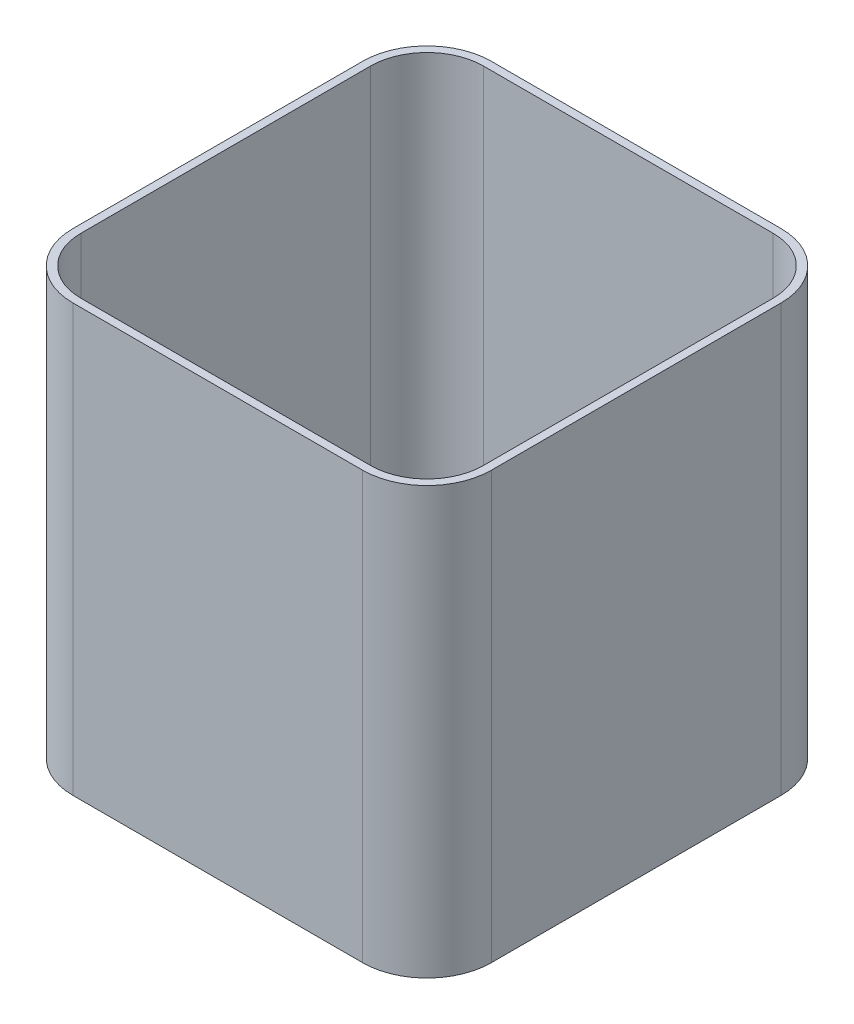
ISO-10303-21;
HEADER;
FILE_DESCRIPTION(('STEP AP214'),'2;1');
FILE_NAME('part.step','',(''),(''),'','','');
FILE_SCHEMA(('AUTOMOTIVE_DESIGN { 1 0 10303 214 1 1 1 1 }'));
ENDSEC;
DATA;
#1=APPLICATION_CONTEXT('core data for automotive mechanical design processes');
#2=APPLICATION_PROTOCOL_DEFINITION('international standard','automotive_design',2000,#1);
#3=PRODUCT_CONTEXT('',#1,'mechanical');
#4=PRODUCT('Part','Part','',(#3));
#5=PRODUCT_RELATED_PRODUCT_CATEGORY('part','',(#4));
#6=PRODUCT_DEFINITION_FORMATION('','',#4);
#7=PRODUCT_DEFINITION_CONTEXT('part definition',#1,'design');
#8=PRODUCT_DEFINITION('design','',#6,#7);
#9=PRODUCT_DEFINITION_SHAPE('','',#8);
#10=(LENGTH_UNIT() NAMED_UNIT(*) SI_UNIT(.MILLI.,.METRE.));
#11=(NAMED_UNIT(*) PLANE_ANGLE_UNIT() SI_UNIT($,.RADIAN.));
#12=(NAMED_UNIT(*) SI_UNIT($,.STERADIAN.) SOLID_ANGLE_UNIT());
#13=UNCERTAINTY_MEASURE_WITH_UNIT(LENGTH_MEASURE(1.E-05),#10,'distance_accuracy_value','');
#14=(GEOMETRIC_REPRESENTATION_CONTEXT(3) GLOBAL_UNCERTAINTY_ASSIGNED_CONTEXT((#13)) GLOBAL_UNIT_ASSIGNED_CONTEXT((#10,
#11,#12)) REPRESENTATION_CONTEXT('',''));
#15=CARTESIAN_POINT('',(0.,0.,0.));
#16=DIRECTION('',(0.,0.,1.));
#17=DIRECTION('',(1.,0.,0.));
#18=AXIS2_PLACEMENT_3D('',#15,#16,#17);
#19=CARTESIAN_POINT('',(114.3,336.55,114.3));
#20=DIRECTION('',(0.,1.,0.));
#21=DIRECTION('',(0.,0.,1.));
#22=AXIS2_PLACEMENT_3D('',#19,#20,#21);
#23=PLANE('',#22);
#24=CARTESIAN_POINT('',(114.3,336.55,114.3));
#25=DIRECTION('',(0.,1.,0.));
#26=DIRECTION('',(0.,0.,1.));
#27=AXIS2_PLACEMENT_3D('',#24,#25,#26);
#28=CIRCLE('',#27,50.8);
#29=CARTESIAN_POINT('',(114.3,336.55,165.1));
#30=VERTEX_POINT('',#29);
#31=CARTESIAN_POINT('',(165.1,336.55,114.3));
#32=VERTEX_POINT('',#31);
#33=EDGE_CURVE('E213',#30,#32,#28,.T.);
#34=ORIENTED_EDGE('',*,*,#33,.T.);
#35=DIRECTION('',(0.,0.,-1.));
#36=VECTOR('',#35,1.);
#37=CARTESIAN_POINT('',(165.1,336.55,114.3));
#38=LINE('',#37,#36);
#39=CARTESIAN_POINT('',(165.1,336.55,-114.3));
#40=VERTEX_POINT('',#39);
#41=EDGE_CURVE('E216',#32,#40,#38,.T.);
#42=ORIENTED_EDGE('',*,*,#41,.T.);
#43=CARTESIAN_POINT('',(114.3,336.55,-114.3));
#44=DIRECTION('',(0.,1.,0.));
#45=DIRECTION('',(0.,0.,-1.));
#46=AXIS2_PLACEMENT_3D('',#43,#44,#45);
#47=CIRCLE('',#46,50.8);
#48=CARTESIAN_POINT('',(114.3,336.55,-165.1));
#49=VERTEX_POINT('',#48);
#50=EDGE_CURVE('E219',#40,#49,#47,.T.);
#51=ORIENTED_EDGE('',*,*,#50,.T.);
#52=DIRECTION('',(-1.,0.,0.));
#53=VECTOR('',#52,1.);
#54=CARTESIAN_POINT('',(-114.3,336.55,-165.1));
#55=LINE('',#54,#53);
#56=CARTESIAN_POINT('',(-114.3,336.55,-165.1));
#57=VERTEX_POINT('',#56);
#58=EDGE_CURVE('E221',#49,#57,#55,.T.);
#59=ORIENTED_EDGE('',*,*,#58,.T.);
#60=CARTESIAN_POINT('',(-114.3,336.55,-114.3));
#61=DIRECTION('',(0.,1.,0.));
#62=DIRECTION('',(0.,0.,-1.));
#63=AXIS2_PLACEMENT_3D('',#60,#61,#62);
#64=CIRCLE('',#63,50.8);
#65=CARTESIAN_POINT('',(-165.1,336.55,-114.3));
#66=VERTEX_POINT('',#65);
#67=EDGE_CURVE('E223',#57,#66,#64,.T.);
#68=ORIENTED_EDGE('',*,*,#67,.T.);
#69=DIRECTION('',(0.,0.,1.));
#70=VECTOR('',#69,1.);
#71=CARTESIAN_POINT('',(-165.1,336.55,114.3));
#72=LINE('',#71,#70);
#73=CARTESIAN_POINT('',(-165.1,336.55,114.3));
#74=VERTEX_POINT('',#73);
#75=EDGE_CURVE('E225',#66,#74,#72,.T.);
#76=ORIENTED_EDGE('',*,*,#75,.T.);
#77=CARTESIAN_POINT('',(-114.3,336.55,114.3));
#78=DIRECTION('',(0.,1.,0.));
#79=DIRECTION('',(0.,0.,-1.));
#80=AXIS2_PLACEMENT_3D('',#77,#78,#79);
#81=CIRCLE('',#80,50.8);
#82=CARTESIAN_POINT('',(-114.3,336.55,165.1));
#83=VERTEX_POINT('',#82);
#84=EDGE_CURVE('E227',#74,#83,#81,.T.);
#85=ORIENTED_EDGE('',*,*,#84,.T.);
#86=DIRECTION('',(1.,0.,0.));
#87=VECTOR('',#86,1.);
#88=CARTESIAN_POINT('',(-114.3,336.55,165.1));
#89=LINE('',#88,#87);
#90=EDGE_CURVE('E229',#83,#30,#89,.T.);
#91=ORIENTED_EDGE('',*,*,#90,.T.);
#92=EDGE_LOOP('',(#34,#42,#51,#59,#68,#76,#85,#91));
#93=FACE_BOUND('',#92,.T.);
#94=DIRECTION('',(0.,0.,1.));
#95=VECTOR('',#94,1.);
#96=CARTESIAN_POINT('',(-158.75,336.55,114.3));
#97=LINE('',#96,#95);
#98=CARTESIAN_POINT('',(-158.75,336.55,-114.3));
#99=VERTEX_POINT('',#98);
#100=CARTESIAN_POINT('',(-158.75,336.55,114.3));
#101=VERTEX_POINT('',#100);
#102=EDGE_CURVE('E156',#99,#101,#97,.T.);
#103=ORIENTED_EDGE('',*,*,#102,.F.);
#104=CARTESIAN_POINT('',(-114.3,336.55,-114.3));
#105=DIRECTION('',(0.,1.,0.));
#106=DIRECTION('',(0.,0.,-1.));
#107=AXIS2_PLACEMENT_3D('',#104,#105,#106);
#108=CIRCLE('',#107,44.45);
#109=CARTESIAN_POINT('',(-114.3,336.55,-158.75));
#110=VERTEX_POINT('',#109);
#111=EDGE_CURVE('E148',#110,#99,#108,.T.);
#112=ORIENTED_EDGE('',*,*,#111,.F.);
#113=DIRECTION('',(-1.,0.,0.));
#114=VECTOR('',#113,1.);
#115=CARTESIAN_POINT('',(-114.3,336.55,-158.75));
#116=LINE('',#115,#114);
#117=CARTESIAN_POINT('',(114.3,336.55,-158.75));
#118=VERTEX_POINT('',#117);
#119=EDGE_CURVE('E181',#118,#110,#116,.T.);
#120=ORIENTED_EDGE('',*,*,#119,.F.);
#121=CARTESIAN_POINT('',(114.3,336.55,-114.3));
#122=DIRECTION('',(0.,1.,0.));
#123=DIRECTION('',(0.,0.,-1.));
#124=AXIS2_PLACEMENT_3D('',#121,#122,#123);
#125=CIRCLE('',#124,44.45);
#126=CARTESIAN_POINT('',(158.75,336.55,-114.3));
#127=VERTEX_POINT('',#126);
#128=EDGE_CURVE('E179',#127,#118,#125,.T.);
#129=ORIENTED_EDGE('',*,*,#128,.F.);
#130=DIRECTION('',(0.,0.,-1.));
#131=VECTOR('',#130,1.);
#132=CARTESIAN_POINT('',(158.75,336.55,114.3));
#133=LINE('',#132,#131);
#134=CARTESIAN_POINT('',(158.75,336.55,114.3));
#135=VERTEX_POINT('',#134);
#136=EDGE_CURVE('E177',#135,#127,#133,.T.);
#137=ORIENTED_EDGE('',*,*,#136,.F.);
#138=CARTESIAN_POINT('',(114.3,336.55,114.3));
#139=DIRECTION('',(0.,1.,0.));
#140=DIRECTION('',(0.,0.,1.));
#141=AXIS2_PLACEMENT_3D('',#138,#139,#140);
#142=CIRCLE('',#141,44.45);
#143=CARTESIAN_POINT('',(114.3,336.55,158.75));
#144=VERTEX_POINT('',#143);
#145=EDGE_CURVE('E175',#144,#135,#142,.T.);
#146=ORIENTED_EDGE('',*,*,#145,.F.);
#147=DIRECTION('',(1.,0.,0.));
#148=VECTOR('',#147,1.);
#149=CARTESIAN_POINT('',(-114.3,336.55,158.75));
#150=LINE('',#149,#148);
#151=CARTESIAN_POINT('',(-114.3,336.55,158.75));
#152=VERTEX_POINT('',#151);
#153=EDGE_CURVE('E171',#152,#144,#150,.T.);
#154=ORIENTED_EDGE('',*,*,#153,.F.);
#155=CARTESIAN_POINT('',(-114.3,336.55,114.3));
#156=DIRECTION('',(0.,1.,0.));
#157=DIRECTION('',(0.,0.,-1.));
#158=AXIS2_PLACEMENT_3D('',#155,#156,#157);
#159=CIRCLE('',#158,44.45);
#160=EDGE_CURVE('E169',#101,#152,#159,.T.);
#161=ORIENTED_EDGE('',*,*,#160,.F.);
#162=EDGE_LOOP('',(#103,#112,#120,#129,#137,#146,#154,#161));
#163=FACE_BOUND('',#162,.T.);
#164=ADVANCED_FACE('F35',(#93,#163),#23,.T.);
#165=CARTESIAN_POINT('',(114.3,0.,114.3));
#166=DIRECTION('',(0.,1.,0.));
#167=DIRECTION('',(0.,0.,1.));
#168=AXIS2_PLACEMENT_3D('',#165,#166,#167);
#169=PLANE('',#168);
#170=CARTESIAN_POINT('',(114.3,0.,114.3));
#171=DIRECTION('',(0.,1.,0.));
#172=DIRECTION('',(0.,0.,1.));
#173=AXIS2_PLACEMENT_3D('',#170,#171,#172);
#174=CIRCLE('',#173,50.8);
#175=CARTESIAN_POINT('',(114.3,0.,165.1));
#176=VERTEX_POINT('',#175);
#177=CARTESIAN_POINT('',(165.1,0.,114.3));
#178=VERTEX_POINT('',#177);
#179=EDGE_CURVE('E164',#176,#178,#174,.T.);
#180=ORIENTED_EDGE('',*,*,#179,.F.);
#181=DIRECTION('',(1.,0.,0.));
#182=VECTOR('',#181,1.);
#183=CARTESIAN_POINT('',(-114.3,0.,165.1));
#184=LINE('',#183,#182);
#185=CARTESIAN_POINT('',(-114.3,0.,165.1));
#186=VERTEX_POINT('',#185);
#187=EDGE_CURVE('E217',#186,#176,#184,.T.);
#188=ORIENTED_EDGE('',*,*,#187,.F.);
#189=CARTESIAN_POINT('',(-114.3,0.,114.3));
#190=DIRECTION('',(0.,1.,0.));
#191=DIRECTION('',(0.,0.,-1.));
#192=AXIS2_PLACEMENT_3D('',#189,#190,#191);
#193=CIRCLE('',#192,50.8);
#194=CARTESIAN_POINT('',(-165.1,0.,114.3));
#195=VERTEX_POINT('',#194);
#196=EDGE_CURVE('E244',#195,#186,#193,.T.);
#197=ORIENTED_EDGE('',*,*,#196,.F.);
#198=DIRECTION('',(0.,0.,1.));
#199=VECTOR('',#198,1.);
#200=CARTESIAN_POINT('',(-165.1,0.,114.3));
#201=LINE('',#200,#199);
#202=CARTESIAN_POINT('',(-165.1,0.,-114.3));
#203=VERTEX_POINT('',#202);
#204=EDGE_CURVE('E242',#203,#195,#201,.T.);
#205=ORIENTED_EDGE('',*,*,#204,.F.);
#206=CARTESIAN_POINT('',(-114.3,0.,-114.3));
#207=DIRECTION('',(0.,1.,0.));
#208=DIRECTION('',(0.,0.,-1.));
#209=AXIS2_PLACEMENT_3D('',#206,#207,#208);
#210=CIRCLE('',#209,50.8);
#211=CARTESIAN_POINT('',(-114.3,0.,-165.1));
#212=VERTEX_POINT('',#211);
#213=EDGE_CURVE('E240',#212,#203,#210,.T.);
#214=ORIENTED_EDGE('',*,*,#213,.F.);
#215=DIRECTION('',(-1.,0.,0.));
#216=VECTOR('',#215,1.);
#217=CARTESIAN_POINT('',(-114.3,0.,-165.1));
#218=LINE('',#217,#216);
#219=CARTESIAN_POINT('',(114.3,0.,-165.1));
#220=VERTEX_POINT('',#219);
#221=EDGE_CURVE('E238',#220,#212,#218,.T.);
#222=ORIENTED_EDGE('',*,*,#221,.F.);
#223=CARTESIAN_POINT('',(114.3,0.,-114.3));
#224=DIRECTION('',(0.,1.,0.));
#225=DIRECTION('',(0.,0.,-1.));
#226=AXIS2_PLACEMENT_3D('',#223,#224,#225);
#227=CIRCLE('',#226,50.8);
#228=CARTESIAN_POINT('',(165.1,0.,-114.3));
#229=VERTEX_POINT('',#228);
#230=EDGE_CURVE('E236',#229,#220,#227,.T.);
#231=ORIENTED_EDGE('',*,*,#230,.F.);
#232=DIRECTION('',(0.,0.,-1.));
#233=VECTOR('',#232,1.);
#234=CARTESIAN_POINT('',(165.1,0.,114.3));
#235=LINE('',#234,#233);
#236=EDGE_CURVE('E234',#178,#229,#235,.T.);
#237=ORIENTED_EDGE('',*,*,#236,.F.);
#238=EDGE_LOOP('',(#180,#188,#197,#205,#214,#222,#231,#237));
#239=FACE_BOUND('',#238,.T.);
#240=CARTESIAN_POINT('',(-114.3,0.,-114.3));
#241=DIRECTION('',(0.,1.,0.));
#242=DIRECTION('',(0.,0.,-1.));
#243=AXIS2_PLACEMENT_3D('',#240,#241,#242);
#244=CIRCLE('',#243,44.45);
#245=CARTESIAN_POINT('',(-114.3,0.,-158.75));
#246=VERTEX_POINT('',#245);
#247=CARTESIAN_POINT('',(-158.75,0.,-114.3));
#248=VERTEX_POINT('',#247);
#249=EDGE_CURVE('E58',#246,#248,#244,.T.);
#250=ORIENTED_EDGE('',*,*,#249,.T.);
#251=DIRECTION('',(0.,0.,1.));
#252=VECTOR('',#251,1.);
#253=CARTESIAN_POINT('',(-158.75,0.,114.3));
#254=LINE('',#253,#252);
#255=CARTESIAN_POINT('',(-158.75,0.,114.3));
#256=VERTEX_POINT('',#255);
#257=EDGE_CURVE('E163',#248,#256,#254,.T.);
#258=ORIENTED_EDGE('',*,*,#257,.T.);
#259=CARTESIAN_POINT('',(-114.3,0.,114.3));
#260=DIRECTION('',(0.,1.,0.));
#261=DIRECTION('',(0.,0.,-1.));
#262=AXIS2_PLACEMENT_3D('',#259,#260,#261);
#263=CIRCLE('',#262,44.45);
#264=CARTESIAN_POINT('',(-114.3,0.,158.75));
#265=VERTEX_POINT('',#264);
#266=EDGE_CURVE('E185',#256,#265,#263,.T.);
#267=ORIENTED_EDGE('',*,*,#266,.T.);
#268=DIRECTION('',(1.,0.,0.));
#269=VECTOR('',#268,1.);
#270=CARTESIAN_POINT('',(-114.3,0.,158.75));
#271=LINE('',#270,#269);
#272=CARTESIAN_POINT('',(114.3,0.,158.75));
#273=VERTEX_POINT('',#272);
#274=EDGE_CURVE('E188',#265,#273,#271,.T.);
#275=ORIENTED_EDGE('',*,*,#274,.T.);
#276=CARTESIAN_POINT('',(114.3,0.,114.3));
#277=DIRECTION('',(0.,1.,0.));
#278=DIRECTION('',(0.,0.,1.));
#279=AXIS2_PLACEMENT_3D('',#276,#277,#278);
#280=CIRCLE('',#279,44.45);
#281=CARTESIAN_POINT('',(158.75,0.,114.3));
#282=VERTEX_POINT('',#281);
#283=EDGE_CURVE('E191',#273,#282,#280,.T.);
#284=ORIENTED_EDGE('',*,*,#283,.T.);
#285=DIRECTION('',(0.,0.,-1.));
#286=VECTOR('',#285,1.);
#287=CARTESIAN_POINT('',(158.75,0.,114.3));
#288=LINE('',#287,#286);
#289=CARTESIAN_POINT('',(158.75,0.,-114.3));
#290=VERTEX_POINT('',#289);
#291=EDGE_CURVE('E194',#282,#290,#288,.T.);
#292=ORIENTED_EDGE('',*,*,#291,.T.);
#293=CARTESIAN_POINT('',(114.3,0.,-114.3));
#294=DIRECTION('',(0.,1.,0.));
#295=DIRECTION('',(0.,0.,-1.));
#296=AXIS2_PLACEMENT_3D('',#293,#294,#295);
#297=CIRCLE('',#296,44.45);
#298=CARTESIAN_POINT('',(114.3,0.,-158.75));
#299=VERTEX_POINT('',#298);
#300=EDGE_CURVE('E197',#290,#299,#297,.T.);
#301=ORIENTED_EDGE('',*,*,#300,.T.);
#302=DIRECTION('',(-1.,0.,0.));
#303=VECTOR('',#302,1.);
#304=CARTESIAN_POINT('',(-114.3,0.,-158.75));
#305=LINE('',#304,#303);
#306=EDGE_CURVE('E157',#299,#246,#305,.T.);
#307=ORIENTED_EDGE('',*,*,#306,.T.);
#308=EDGE_LOOP('',(#250,#258,#267,#275,#284,#292,#301,#307));
#309=FACE_BOUND('',#308,.T.);
#310=ADVANCED_FACE('F274',(#239,#309),#169,.F.);
#311=CARTESIAN_POINT('',(114.3,336.55,114.3));
#312=DIRECTION('',(0.,-1.,0.));
#313=DIRECTION('',(0.,0.,-1.));
#314=AXIS2_PLACEMENT_3D('',#311,#312,#313);
#315=CYLINDRICAL_SURFACE('',#314,50.8);
#316=ORIENTED_EDGE('',*,*,#179,.T.);
#317=DIRECTION('',(0.,-1.,0.));
#318=VECTOR('',#317,1.);
#319=CARTESIAN_POINT('',(165.1,336.55,114.3));
#320=LINE('',#319,#318);
#321=EDGE_CURVE('E11',#32,#178,#320,.T.);
#322=ORIENTED_EDGE('',*,*,#321,.F.);
#323=ORIENTED_EDGE('',*,*,#33,.F.);
#324=DIRECTION('',(0.,-1.,0.));
#325=VECTOR('',#324,1.);
#326=CARTESIAN_POINT('',(114.3,336.55,165.1));
#327=LINE('',#326,#325);
#328=EDGE_CURVE('E231',#30,#176,#327,.T.);
#329=ORIENTED_EDGE('',*,*,#328,.T.);
#330=EDGE_LOOP('',(#316,#322,#323,#329));
#331=FACE_BOUND('',#330,.T.);
#332=ADVANCED_FACE('F37',(#331),#315,.T.);
#333=CARTESIAN_POINT('',(165.1,336.55,114.3));
#334=DIRECTION('',(-1.,0.,0.));
#335=DIRECTION('',(0.,0.,1.));
#336=AXIS2_PLACEMENT_3D('',#333,#334,#335);
#337=PLANE('',#336);
#338=ORIENTED_EDGE('',*,*,#236,.T.);
#339=DIRECTION('',(0.,-1.,0.));
#340=VECTOR('',#339,1.);
#341=CARTESIAN_POINT('',(165.1,336.55,-114.3));
#342=LINE('',#341,#340);
#343=EDGE_CURVE('E43',#40,#229,#342,.T.);
#344=ORIENTED_EDGE('',*,*,#343,.F.);
#345=ORIENTED_EDGE('',*,*,#41,.F.);
#346=ORIENTED_EDGE('',*,*,#321,.T.);
#347=EDGE_LOOP('',(#338,#344,#345,#346));
#348=FACE_BOUND('',#347,.T.);
#349=ADVANCED_FACE('F291',(#348),#337,.F.);
#350=CARTESIAN_POINT('',(114.3,336.55,-114.3));
#351=DIRECTION('',(0.,-1.,0.));
#352=DIRECTION('',(0.,0.,-1.));
#353=AXIS2_PLACEMENT_3D('',#350,#351,#352);
#354=CYLINDRICAL_SURFACE('',#353,50.8);
#355=ORIENTED_EDGE('',*,*,#230,.T.);
#356=DIRECTION('',(0.,-1.,0.));
#357=VECTOR('',#356,1.);
#358=CARTESIAN_POINT('',(114.3,336.55,-165.1));
#359=LINE('',#358,#357);
#360=EDGE_CURVE('E261',#49,#220,#359,.T.);
#361=ORIENTED_EDGE('',*,*,#360,.F.);
#362=ORIENTED_EDGE('',*,*,#50,.F.);
#363=ORIENTED_EDGE('',*,*,#343,.T.);
#364=EDGE_LOOP('',(#355,#361,#362,#363));
#365=FACE_BOUND('',#364,.T.);
#366=ADVANCED_FACE('F268',(#365),#354,.T.);
#367=CARTESIAN_POINT('',(-114.3,336.55,-165.1));
#368=DIRECTION('',(0.,0.,1.));
#369=DIRECTION('',(1.,0.,0.));
#370=AXIS2_PLACEMENT_3D('',#367,#368,#369);
#371=PLANE('',#370);
#372=ORIENTED_EDGE('',*,*,#221,.T.);
#373=DIRECTION('',(0.,-1.,0.));
#374=VECTOR('',#373,1.);
#375=CARTESIAN_POINT('',(-114.3,336.55,-165.1));
#376=LINE('',#375,#374);
#377=EDGE_CURVE('E258',#57,#212,#376,.T.);
#378=ORIENTED_EDGE('',*,*,#377,.F.);
#379=ORIENTED_EDGE('',*,*,#58,.F.);
#380=ORIENTED_EDGE('',*,*,#360,.T.);
#381=EDGE_LOOP('',(#372,#378,#379,#380));
#382=FACE_BOUND('',#381,.T.);
#383=ADVANCED_FACE('F280',(#382),#371,.F.);
#384=CARTESIAN_POINT('',(-114.3,336.55,-114.3));
#385=DIRECTION('',(0.,-1.,0.));
#386=DIRECTION('',(0.,0.,-1.));
#387=AXIS2_PLACEMENT_3D('',#384,#385,#386);
#388=CYLINDRICAL_SURFACE('',#387,50.8);
#389=ORIENTED_EDGE('',*,*,#213,.T.);
#390=DIRECTION('',(0.,-1.,0.));
#391=VECTOR('',#390,1.);
#392=CARTESIAN_POINT('',(-165.1,336.55,-114.3));
#393=LINE('',#392,#391);
#394=EDGE_CURVE('E255',#66,#203,#393,.T.);
#395=ORIENTED_EDGE('',*,*,#394,.F.);
#396=ORIENTED_EDGE('',*,*,#67,.F.);
#397=ORIENTED_EDGE('',*,*,#377,.T.);
#398=EDGE_LOOP('',(#389,#395,#396,#397));
#399=FACE_BOUND('',#398,.T.);
#400=ADVANCED_FACE('F284',(#399),#388,.T.);
#401=CARTESIAN_POINT('',(-165.1,336.55,114.3));
#402=DIRECTION('',(1.,0.,0.));
#403=DIRECTION('',(0.,0.,-1.));
#404=AXIS2_PLACEMENT_3D('',#401,#402,#403);
#405=PLANE('',#404);
#406=ORIENTED_EDGE('',*,*,#204,.T.);
#407=DIRECTION('',(0.,-1.,0.));
#408=VECTOR('',#407,1.);
#409=CARTESIAN_POINT('',(-165.1,336.55,114.3));
#410=LINE('',#409,#408);
#411=EDGE_CURVE('E252',#74,#195,#410,.T.);
#412=ORIENTED_EDGE('',*,*,#411,.F.);
#413=ORIENTED_EDGE('',*,*,#75,.F.);
#414=ORIENTED_EDGE('',*,*,#394,.T.);
#415=EDGE_LOOP('',(#406,#412,#413,#414));
#416=FACE_BOUND('',#415,.T.);
#417=ADVANCED_FACE('F304',(#416),#405,.F.);
#418=CARTESIAN_POINT('',(-114.3,336.55,114.3));
#419=DIRECTION('',(0.,-1.,0.));
#420=DIRECTION('',(0.,0.,-1.));
#421=AXIS2_PLACEMENT_3D('',#418,#419,#420);
#422=CYLINDRICAL_SURFACE('',#421,50.8);
#423=ORIENTED_EDGE('',*,*,#196,.T.);
#424=DIRECTION('',(0.,-1.,0.));
#425=VECTOR('',#424,1.);
#426=CARTESIAN_POINT('',(-114.3,336.55,165.1));
#427=LINE('',#426,#425);
#428=EDGE_CURVE('E249',#83,#186,#427,.T.);
#429=ORIENTED_EDGE('',*,*,#428,.F.);
#430=ORIENTED_EDGE('',*,*,#84,.F.);
#431=ORIENTED_EDGE('',*,*,#411,.T.);
#432=EDGE_LOOP('',(#423,#429,#430,#431));
#433=FACE_BOUND('',#432,.T.);
#434=ADVANCED_FACE('F302',(#433),#422,.T.);
#435=CARTESIAN_POINT('',(-114.3,336.55,165.1));
#436=DIRECTION('',(0.,0.,-1.));
#437=DIRECTION('',(-1.,0.,0.));
#438=AXIS2_PLACEMENT_3D('',#435,#436,#437);
#439=PLANE('',#438);
#440=ORIENTED_EDGE('',*,*,#187,.T.);
#441=ORIENTED_EDGE('',*,*,#328,.F.);
#442=ORIENTED_EDGE('',*,*,#90,.F.);
#443=ORIENTED_EDGE('',*,*,#428,.T.);
#444=EDGE_LOOP('',(#440,#441,#442,#443));
#445=FACE_BOUND('',#444,.T.);
#446=ADVANCED_FACE('F297',(#445),#439,.F.);
#447=CARTESIAN_POINT('',(-114.3,336.55,-114.3));
#448=DIRECTION('',(0.,-1.,0.));
#449=DIRECTION('',(0.,0.,-1.));
#450=AXIS2_PLACEMENT_3D('',#447,#448,#449);
#451=CYLINDRICAL_SURFACE('',#450,44.45);
#452=ORIENTED_EDGE('',*,*,#249,.F.);
#453=DIRECTION('',(0.,-1.,0.));
#454=VECTOR('',#453,1.);
#455=CARTESIAN_POINT('',(-114.3,336.55,-158.75));
#456=LINE('',#455,#454);
#457=EDGE_CURVE('E152',#110,#246,#456,.T.);
#458=ORIENTED_EDGE('',*,*,#457,.F.);
#459=ORIENTED_EDGE('',*,*,#111,.T.);
#460=DIRECTION('',(0.,-1.,0.));
#461=VECTOR('',#460,1.);
#462=CARTESIAN_POINT('',(-158.75,336.55,-114.3));
#463=LINE('',#462,#461);
#464=EDGE_CURVE('E151',#99,#248,#463,.T.);
#465=ORIENTED_EDGE('',*,*,#464,.T.);
#466=EDGE_LOOP('',(#452,#458,#459,#465));
#467=FACE_BOUND('',#466,.T.);
#468=ADVANCED_FACE('F150',(#467),#451,.F.);
#469=CARTESIAN_POINT('',(-158.75,336.55,114.3));
#470=DIRECTION('',(1.,0.,0.));
#471=DIRECTION('',(0.,0.,-1.));
#472=AXIS2_PLACEMENT_3D('',#469,#470,#471);
#473=PLANE('',#472);
#474=ORIENTED_EDGE('',*,*,#257,.F.);
#475=ORIENTED_EDGE('',*,*,#464,.F.);
#476=ORIENTED_EDGE('',*,*,#102,.T.);
#477=DIRECTION('',(0.,-1.,0.));
#478=VECTOR('',#477,1.);
#479=CARTESIAN_POINT('',(-158.75,336.55,114.3));
#480=LINE('',#479,#478);
#481=EDGE_CURVE('E165',#101,#256,#480,.T.);
#482=ORIENTED_EDGE('',*,*,#481,.T.);
#483=EDGE_LOOP('',(#474,#475,#476,#482));
#484=FACE_BOUND('',#483,.T.);
#485=ADVANCED_FACE('F160',(#484),#473,.T.);
#486=CARTESIAN_POINT('',(-114.3,336.55,114.3));
#487=DIRECTION('',(0.,-1.,0.));
#488=DIRECTION('',(0.,0.,-1.));
#489=AXIS2_PLACEMENT_3D('',#486,#487,#488);
#490=CYLINDRICAL_SURFACE('',#489,44.45);
#491=ORIENTED_EDGE('',*,*,#266,.F.);
#492=ORIENTED_EDGE('',*,*,#481,.F.);
#493=ORIENTED_EDGE('',*,*,#160,.T.);
#494=DIRECTION('',(0.,-1.,0.));
#495=VECTOR('',#494,1.);
#496=CARTESIAN_POINT('',(-114.3,336.55,158.75));
#497=LINE('',#496,#495);
#498=EDGE_CURVE('E210',#152,#265,#497,.T.);
#499=ORIENTED_EDGE('',*,*,#498,.T.);
#500=EDGE_LOOP('',(#491,#492,#493,#499));
#501=FACE_BOUND('',#500,.T.);
#502=ADVANCED_FACE('F329',(#501),#490,.F.);
#503=CARTESIAN_POINT('',(-114.3,336.55,158.75));
#504=DIRECTION('',(0.,0.,-1.));
#505=DIRECTION('',(-1.,0.,0.));
#506=AXIS2_PLACEMENT_3D('',#503,#504,#505);
#507=PLANE('',#506);
#508=ORIENTED_EDGE('',*,*,#274,.F.);
#509=ORIENTED_EDGE('',*,*,#498,.F.);
#510=ORIENTED_EDGE('',*,*,#153,.T.);
#511=DIRECTION('',(0.,-1.,0.));
#512=VECTOR('',#511,1.);
#513=CARTESIAN_POINT('',(114.3,336.55,158.75));
#514=LINE('',#513,#512);
#515=EDGE_CURVE('E208',#144,#273,#514,.T.);
#516=ORIENTED_EDGE('',*,*,#515,.T.);
#517=EDGE_LOOP('',(#508,#509,#510,#516));
#518=FACE_BOUND('',#517,.T.);
#519=ADVANCED_FACE('F333',(#518),#507,.T.);
#520=CARTESIAN_POINT('',(114.3,336.55,114.3));
#521=DIRECTION('',(0.,-1.,0.));
#522=DIRECTION('',(0.,0.,-1.));
#523=AXIS2_PLACEMENT_3D('',#520,#521,#522);
#524=CYLINDRICAL_SURFACE('',#523,44.45);
#525=ORIENTED_EDGE('',*,*,#283,.F.);
#526=ORIENTED_EDGE('',*,*,#515,.F.);
#527=ORIENTED_EDGE('',*,*,#145,.T.);
#528=DIRECTION('',(0.,-1.,0.));
#529=VECTOR('',#528,1.);
#530=CARTESIAN_POINT('',(158.75,336.55,114.3));
#531=LINE('',#530,#529);
#532=EDGE_CURVE('E206',#135,#282,#531,.T.);
#533=ORIENTED_EDGE('',*,*,#532,.T.);
#534=EDGE_LOOP('',(#525,#526,#527,#533));
#535=FACE_BOUND('',#534,.T.);
#536=ADVANCED_FACE('F339',(#535),#524,.F.);
#537=CARTESIAN_POINT('',(158.75,336.55,114.3));
#538=DIRECTION('',(-1.,0.,0.));
#539=DIRECTION('',(0.,0.,1.));
#540=AXIS2_PLACEMENT_3D('',#537,#538,#539);
#541=PLANE('',#540);
#542=ORIENTED_EDGE('',*,*,#291,.F.);
#543=ORIENTED_EDGE('',*,*,#532,.F.);
#544=ORIENTED_EDGE('',*,*,#136,.T.);
#545=DIRECTION('',(0.,-1.,0.));
#546=VECTOR('',#545,1.);
#547=CARTESIAN_POINT('',(158.75,336.55,-114.3));
#548=LINE('',#547,#546);
#549=EDGE_CURVE('E204',#127,#290,#548,.T.);
#550=ORIENTED_EDGE('',*,*,#549,.T.);
#551=EDGE_LOOP('',(#542,#543,#544,#550));
#552=FACE_BOUND('',#551,.T.);
#553=ADVANCED_FACE('F343',(#552),#541,.T.);
#554=CARTESIAN_POINT('',(114.3,336.55,-114.3));
#555=DIRECTION('',(0.,-1.,0.));
#556=DIRECTION('',(0.,0.,-1.));
#557=AXIS2_PLACEMENT_3D('',#554,#555,#556);
#558=CYLINDRICAL_SURFACE('',#557,44.45);
#559=ORIENTED_EDGE('',*,*,#300,.F.);
#560=ORIENTED_EDGE('',*,*,#549,.F.);
#561=ORIENTED_EDGE('',*,*,#128,.T.);
#562=DIRECTION('',(0.,-1.,0.));
#563=VECTOR('',#562,1.);
#564=CARTESIAN_POINT('',(114.3,336.55,-158.75));
#565=LINE('',#564,#563);
#566=EDGE_CURVE('E50',#118,#299,#565,.T.);
#567=ORIENTED_EDGE('',*,*,#566,.T.);
#568=EDGE_LOOP('',(#559,#560,#561,#567));
#569=FACE_BOUND('',#568,.T.);
#570=ADVANCED_FACE('F347',(#569),#558,.F.);
#571=CARTESIAN_POINT('',(-114.3,336.55,-158.75));
#572=DIRECTION('',(0.,0.,1.));
#573=DIRECTION('',(1.,0.,0.));
#574=AXIS2_PLACEMENT_3D('',#571,#572,#573);
#575=PLANE('',#574);
#576=ORIENTED_EDGE('',*,*,#306,.F.);
#577=ORIENTED_EDGE('',*,*,#566,.F.);
#578=ORIENTED_EDGE('',*,*,#119,.T.);
#579=ORIENTED_EDGE('',*,*,#457,.T.);
#580=EDGE_LOOP('',(#576,#577,#578,#579));
#581=FACE_BOUND('',#580,.T.);
#582=ADVANCED_FACE('F351',(#581),#575,.T.);
#583=CLOSED_SHELL('',(#164,#310,#332,#349,#366,#383,#400,#417,#434,#446,#468,#485,#502,#519,
#536,#553,#570,#582));
#584=MANIFOLD_SOLID_BREP('B2',#583);
#585=ADVANCED_BREP_SHAPE_REPRESENTATION('',(#18,#584),#14);
#586=SHAPE_DEFINITION_REPRESENTATION(#9,#585);
ENDSEC;
END-ISO-10303-21;
